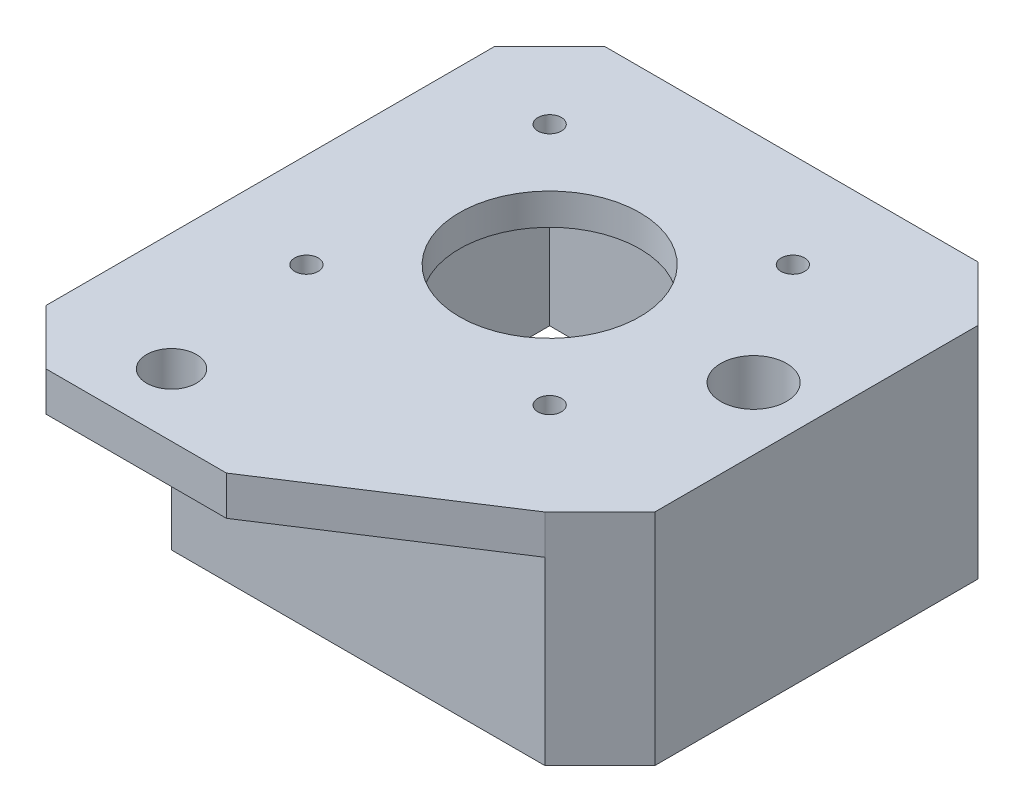
ISO-10303-21;
HEADER;
FILE_DESCRIPTION(('STEP AP214'),'2;1');
FILE_NAME('part.step','',(''),(''),'','','');
FILE_SCHEMA(('AUTOMOTIVE_DESIGN { 1 0 10303 214 1 1 1 1 }'));
ENDSEC;
DATA;
#1=APPLICATION_CONTEXT('core data for automotive mechanical design processes');
#2=APPLICATION_PROTOCOL_DEFINITION('international standard','automotive_design',2000,#1);
#3=PRODUCT_CONTEXT('',#1,'mechanical');
#4=PRODUCT('Part','Part','',(#3));
#5=PRODUCT_RELATED_PRODUCT_CATEGORY('part','',(#4));
#6=PRODUCT_DEFINITION_FORMATION('','',#4);
#7=PRODUCT_DEFINITION_CONTEXT('part definition',#1,'design');
#8=PRODUCT_DEFINITION('design','',#6,#7);
#9=PRODUCT_DEFINITION_SHAPE('','',#8);
#10=(LENGTH_UNIT() NAMED_UNIT(*) SI_UNIT(.MILLI.,.METRE.));
#11=(NAMED_UNIT(*) PLANE_ANGLE_UNIT() SI_UNIT($,.RADIAN.));
#12=(NAMED_UNIT(*) SI_UNIT($,.STERADIAN.) SOLID_ANGLE_UNIT());
#13=UNCERTAINTY_MEASURE_WITH_UNIT(LENGTH_MEASURE(1.E-05),#10,'distance_accuracy_value','');
#14=(GEOMETRIC_REPRESENTATION_CONTEXT(3) GLOBAL_UNCERTAINTY_ASSIGNED_CONTEXT((#13)) GLOBAL_UNIT_ASSIGNED_CONTEXT((#10,
#11,#12)) REPRESENTATION_CONTEXT('',''));
#15=CARTESIAN_POINT('',(0.,0.,0.));
#16=DIRECTION('',(0.,0.,1.));
#17=DIRECTION('',(1.,0.,0.));
#18=AXIS2_PLACEMENT_3D('',#15,#16,#17);
#19=CARTESIAN_POINT('',(48.6,-102.064588642995,6.6));
#20=DIRECTION('',(0.,0.,-1.));
#21=DIRECTION('',(-1.,0.,0.));
#22=AXIS2_PLACEMENT_3D('',#19,#20,#21);
#23=PLANE('',#22);
#24=DIRECTION('',(1.,0.,0.));
#25=VECTOR('',#24,1.);
#26=CARTESIAN_POINT('',(0.,-1.,6.6));
#27=LINE('',#26,#25);
#28=CARTESIAN_POINT('',(0.399999999999998,-1.,6.59999999999999));
#29=VERTEX_POINT('',#28);
#30=CARTESIAN_POINT('',(48.,-1.,6.59999999999999));
#31=VERTEX_POINT('',#30);
#32=EDGE_CURVE('E204',#29,#31,#27,.T.);
#33=ORIENTED_EDGE('',*,*,#32,.F.);
#34=DIRECTION('',(0.,1.,0.));
#35=VECTOR('',#34,1.);
#36=CARTESIAN_POINT('',(0.399999999999998,-33.8994949366117,6.59999999999999));
#37=LINE('',#36,#35);
#38=CARTESIAN_POINT('',(0.399999999999998,-24.,6.6));
#39=VERTEX_POINT('',#38);
#40=EDGE_CURVE('E237',#39,#29,#37,.T.);
#41=ORIENTED_EDGE('',*,*,#40,.F.);
#42=DIRECTION('',(-1.,0.,0.));
#43=VECTOR('',#42,1.);
#44=CARTESIAN_POINT('',(48.6,-24.,6.6));
#45=LINE('',#44,#43);
#46=CARTESIAN_POINT('',(48.,-24.,6.59999999999999));
#47=VERTEX_POINT('',#46);
#48=EDGE_CURVE('E269',#47,#39,#45,.T.);
#49=ORIENTED_EDGE('',*,*,#48,.F.);
#50=DIRECTION('',(0.,1.,0.));
#51=VECTOR('',#50,1.);
#52=CARTESIAN_POINT('',(48.,-33.8994949366117,6.59999999999999));
#53=LINE('',#52,#51);
#54=EDGE_CURVE('E252',#47,#31,#53,.T.);
#55=ORIENTED_EDGE('',*,*,#54,.T.);
#56=EDGE_LOOP('',(#33,#41,#49,#55));
#57=FACE_BOUND('',#56,.T.);
#58=ADVANCED_FACE('F59',(#57),#23,.F.);
#59=CARTESIAN_POINT('',(0.399999999999998,-33.8994949366117,6.59999999999999));
#60=DIRECTION('',(0.707106781186547,0.,-0.707106781186548));
#61=DIRECTION('',(-0.707106781186548,0.,-0.707106781186547));
#62=AXIS2_PLACEMENT_3D('',#59,#60,#61);
#63=PLANE('',#62);
#64=DIRECTION('',(0.707106781186548,0.,0.707106781186547));
#65=VECTOR('',#64,1.);
#66=CARTESIAN_POINT('',(-3.1,-1.,3.1));
#67=LINE('',#66,#65);
#68=CARTESIAN_POINT('',(-6.6,-1.,-0.400000000000005));
#69=VERTEX_POINT('',#68);
#70=EDGE_CURVE('E82',#69,#29,#67,.T.);
#71=ORIENTED_EDGE('',*,*,#70,.F.);
#72=DIRECTION('',(0.,1.,0.));
#73=VECTOR('',#72,1.);
#74=CARTESIAN_POINT('',(-6.6,-33.8994949366117,-0.400000000000005));
#75=LINE('',#74,#73);
#76=CARTESIAN_POINT('',(-6.6,-24.,-0.400000000000005));
#77=VERTEX_POINT('',#76);
#78=EDGE_CURVE('E193',#77,#69,#75,.T.);
#79=ORIENTED_EDGE('',*,*,#78,.F.);
#80=DIRECTION('',(-0.707106781186548,0.,-0.707106781186547));
#81=VECTOR('',#80,1.);
#82=CARTESIAN_POINT('',(0.399999999999998,-24.,6.59999999999999));
#83=LINE('',#82,#81);
#84=EDGE_CURVE('E218',#39,#77,#83,.T.);
#85=ORIENTED_EDGE('',*,*,#84,.F.);
#86=ORIENTED_EDGE('',*,*,#40,.T.);
#87=EDGE_LOOP('',(#71,#79,#85,#86));
#88=FACE_BOUND('',#87,.T.);
#89=ADVANCED_FACE('F375',(#88),#63,.F.);
#90=CARTESIAN_POINT('',(0.,0.,0.));
#91=DIRECTION('',(0.,-1.,0.));
#92=DIRECTION('',(0.,0.,-1.));
#93=AXIS2_PLACEMENT_3D('',#90,#91,#92);
#94=PLANE('',#93);
#95=CARTESIAN_POINT('',(5.5,0.,-5.49999999999998));
#96=DIRECTION('',(0.,1.,0.));
#97=DIRECTION('',(0.,0.,-1.));
#98=AXIS2_PLACEMENT_3D('',#95,#96,#97);
#99=CIRCLE('',#98,1.5);
#100=CARTESIAN_POINT('',(5.5,0.,-6.99999999999999));
#101=VERTEX_POINT('',#100);
#102=EDGE_CURVE('E311',#101,#101,#99,.T.);
#103=ORIENTED_EDGE('',*,*,#102,.T.);
#104=EDGE_LOOP('',(#103));
#105=FACE_BOUND('',#104,.T.);
#106=CARTESIAN_POINT('',(5.5,0.,-36.5));
#107=DIRECTION('',(0.,1.,0.));
#108=DIRECTION('',(0.,0.,1.));
#109=AXIS2_PLACEMENT_3D('',#106,#107,#108);
#110=CIRCLE('',#109,1.5);
#111=CARTESIAN_POINT('',(5.5,0.,-35.));
#112=VERTEX_POINT('',#111);
#113=EDGE_CURVE('E323',#112,#112,#110,.T.);
#114=ORIENTED_EDGE('',*,*,#113,.T.);
#115=EDGE_LOOP('',(#114));
#116=FACE_BOUND('',#115,.T.);
#117=CARTESIAN_POINT('',(21.,0.,-21.));
#118=DIRECTION('',(0.,1.,0.));
#119=DIRECTION('',(0.,0.,1.));
#120=AXIS2_PLACEMENT_3D('',#117,#118,#119);
#121=CIRCLE('',#120,11.5);
#122=CARTESIAN_POINT('',(21.,0.,-9.5));
#123=VERTEX_POINT('',#122);
#124=EDGE_CURVE('E329',#123,#123,#121,.T.);
#125=ORIENTED_EDGE('',*,*,#124,.T.);
#126=EDGE_LOOP('',(#125));
#127=FACE_BOUND('',#126,.T.);
#128=CARTESIAN_POINT('',(36.5,0.,-36.5));
#129=DIRECTION('',(0.,1.,0.));
#130=DIRECTION('',(0.,0.,-1.));
#131=AXIS2_PLACEMENT_3D('',#128,#129,#130);
#132=CIRCLE('',#131,1.5);
#133=CARTESIAN_POINT('',(36.5,0.,-38.));
#134=VERTEX_POINT('',#133);
#135=EDGE_CURVE('E317',#134,#134,#132,.T.);
#136=ORIENTED_EDGE('',*,*,#135,.T.);
#137=EDGE_LOOP('',(#136));
#138=FACE_BOUND('',#137,.T.);
#139=CARTESIAN_POINT('',(36.5,0.,-5.49999999999998));
#140=DIRECTION('',(0.,1.,0.));
#141=DIRECTION('',(0.,0.,1.));
#142=AXIS2_PLACEMENT_3D('',#139,#140,#141);
#143=CIRCLE('',#142,1.5);
#144=CARTESIAN_POINT('',(36.5,0.,-3.99999999999998));
#145=VERTEX_POINT('',#144);
#146=EDGE_CURVE('E306',#145,#145,#143,.T.);
#147=ORIENTED_EDGE('',*,*,#146,.T.);
#148=EDGE_LOOP('',(#147));
#149=FACE_BOUND('',#148,.T.);
#150=DIRECTION('',(-1.,0.,0.));
#151=VECTOR('',#150,1.);
#152=CARTESIAN_POINT('',(42.25,0.,0.249999999999997));
#153=LINE('',#152,#151);
#154=CARTESIAN_POINT('',(42.25,0.,0.249999999999997));
#155=VERTEX_POINT('',#154);
#156=CARTESIAN_POINT('',(-0.25,0.,0.24999999999999));
#157=VERTEX_POINT('',#156);
#158=EDGE_CURVE('E280',#155,#157,#153,.T.);
#159=ORIENTED_EDGE('',*,*,#158,.T.);
#160=DIRECTION('',(0.,0.,-1.));
#161=VECTOR('',#160,1.);
#162=CARTESIAN_POINT('',(-0.25,0.,0.24999999999999));
#163=LINE('',#162,#161);
#164=CARTESIAN_POINT('',(-0.249999999999993,0.,-42.25));
#165=VERTEX_POINT('',#164);
#166=EDGE_CURVE('E277',#157,#165,#163,.T.);
#167=ORIENTED_EDGE('',*,*,#166,.T.);
#168=DIRECTION('',(-1.,0.,0.));
#169=VECTOR('',#168,1.);
#170=CARTESIAN_POINT('',(42.25,0.,-42.25));
#171=LINE('',#170,#169);
#172=CARTESIAN_POINT('',(42.25,0.,-42.25));
#173=VERTEX_POINT('',#172);
#174=EDGE_CURVE('E275',#173,#165,#171,.T.);
#175=ORIENTED_EDGE('',*,*,#174,.F.);
#176=DIRECTION('',(0.,0.,-1.));
#177=VECTOR('',#176,1.);
#178=CARTESIAN_POINT('',(42.25,0.,0.));
#179=LINE('',#178,#177);
#180=EDGE_CURVE('E302',#155,#173,#179,.T.);
#181=ORIENTED_EDGE('',*,*,#180,.F.);
#182=EDGE_LOOP('',(#159,#167,#175,#181));
#183=FACE_BOUND('',#182,.T.);
#184=ADVANCED_FACE('F344',(#105,#116,#127,#138,#149,#183),#94,.T.);
#185=CARTESIAN_POINT('',(0.,4.,0.));
#186=DIRECTION('',(0.,-1.,0.));
#187=DIRECTION('',(0.,0.,-1.));
#188=AXIS2_PLACEMENT_3D('',#185,#186,#187);
#189=PLANE('',#188);
#190=DIRECTION('',(0.838287871127494,0.,-0.545227883660158));
#191=VECTOR('',#190,1.);
#192=CARTESIAN_POINT('',(17.2857076501463,4.,26.5767755121));
#193=LINE('',#192,#191);
#194=CARTESIAN_POINT('',(23.4,4.,22.6));
#195=VERTEX_POINT('',#194);
#196=CARTESIAN_POINT('',(48.,4.,6.6));
#197=VERTEX_POINT('',#196);
#198=EDGE_CURVE('E197',#195,#197,#193,.T.);
#199=ORIENTED_EDGE('',*,*,#198,.T.);
#200=DIRECTION('',(-0.707106781186548,0.,0.707106781186547));
#201=VECTOR('',#200,1.);
#202=CARTESIAN_POINT('',(55.,4.,-0.399999999999998));
#203=LINE('',#202,#201);
#204=CARTESIAN_POINT('',(55.,4.,-0.399999999999998));
#205=VERTEX_POINT('',#204);
#206=EDGE_CURVE('E232',#205,#197,#203,.T.);
#207=ORIENTED_EDGE('',*,*,#206,.F.);
#208=DIRECTION('',(0.,0.,-1.));
#209=VECTOR('',#208,1.);
#210=CARTESIAN_POINT('',(55.,4.,0.));
#211=LINE('',#210,#209);
#212=CARTESIAN_POINT('',(55.,4.,-41.6));
#213=VERTEX_POINT('',#212);
#214=EDGE_CURVE('E12',#205,#213,#211,.T.);
#215=ORIENTED_EDGE('',*,*,#214,.T.);
#216=DIRECTION('',(0.707106781186546,0.,0.707106781186549));
#217=VECTOR('',#216,1.);
#218=CARTESIAN_POINT('',(55.,4.,-41.6));
#219=LINE('',#218,#217);
#220=CARTESIAN_POINT('',(48.,4.,-48.6));
#221=VERTEX_POINT('',#220);
#222=EDGE_CURVE('E222',#221,#213,#219,.T.);
#223=ORIENTED_EDGE('',*,*,#222,.F.);
#224=DIRECTION('',(1.,0.,0.));
#225=VECTOR('',#224,1.);
#226=CARTESIAN_POINT('',(-7.7175125526299,4.,-48.6));
#227=LINE('',#226,#225);
#228=CARTESIAN_POINT('',(0.400000000000005,4.,-48.6));
#229=VERTEX_POINT('',#228);
#230=EDGE_CURVE('E258',#229,#221,#227,.T.);
#231=ORIENTED_EDGE('',*,*,#230,.F.);
#232=DIRECTION('',(0.707106781186548,0.,-0.707106781186547));
#233=VECTOR('',#232,1.);
#234=CARTESIAN_POINT('',(-6.6,4.,-41.6));
#235=LINE('',#234,#233);
#236=CARTESIAN_POINT('',(-6.6,4.,-41.6));
#237=VERTEX_POINT('',#236);
#238=EDGE_CURVE('E234',#237,#229,#235,.T.);
#239=ORIENTED_EDGE('',*,*,#238,.F.);
#240=DIRECTION('',(0.,0.,-1.));
#241=VECTOR('',#240,1.);
#242=CARTESIAN_POINT('',(-6.6,4.,14.3175125526299));
#243=LINE('',#242,#241);
#244=CARTESIAN_POINT('',(-6.6,4.,15.6));
#245=VERTEX_POINT('',#244);
#246=EDGE_CURVE('E256',#245,#237,#243,.T.);
#247=ORIENTED_EDGE('',*,*,#246,.F.);
#248=DIRECTION('',(0.707106781186548,0.,0.707106781186547));
#249=VECTOR('',#248,1.);
#250=CARTESIAN_POINT('',(-11.1,4.,11.1));
#251=LINE('',#250,#249);
#252=CARTESIAN_POINT('',(0.399999999999999,4.,22.6));
#253=VERTEX_POINT('',#252);
#254=EDGE_CURVE('E176',#245,#253,#251,.T.);
#255=ORIENTED_EDGE('',*,*,#254,.T.);
#256=DIRECTION('',(1.,0.,0.));
#257=VECTOR('',#256,1.);
#258=CARTESIAN_POINT('',(0.,4.,22.6));
#259=LINE('',#258,#257);
#260=EDGE_CURVE('E212',#253,#195,#259,.T.);
#261=ORIENTED_EDGE('',*,*,#260,.T.);
#262=EDGE_LOOP('',(#199,#207,#215,#223,#231,#239,#247,#255,#261));
#263=FACE_BOUND('',#262,.T.);
#264=CARTESIAN_POINT('',(47.,4.,-21.));
#265=DIRECTION('',(0.,1.,0.));
#266=DIRECTION('',(0.,0.,1.));
#267=AXIS2_PLACEMENT_3D('',#264,#265,#266);
#268=CIRCLE('',#267,4.2);
#269=CARTESIAN_POINT('',(47.,4.,-16.8));
#270=VERTEX_POINT('',#269);
#271=EDGE_CURVE('E67',#270,#270,#268,.T.);
#272=ORIENTED_EDGE('',*,*,#271,.F.);
#273=EDGE_LOOP('',(#272));
#274=FACE_BOUND('',#273,.T.);
#275=CARTESIAN_POINT('',(21.,4.,-21.));
#276=DIRECTION('',(0.,1.,0.));
#277=DIRECTION('',(0.,0.,1.));
#278=AXIS2_PLACEMENT_3D('',#275,#276,#277);
#279=CIRCLE('',#278,11.5);
#280=CARTESIAN_POINT('',(21.,4.,-9.5));
#281=VERTEX_POINT('',#280);
#282=EDGE_CURVE('E332',#281,#281,#279,.T.);
#283=ORIENTED_EDGE('',*,*,#282,.F.);
#284=EDGE_LOOP('',(#283));
#285=FACE_BOUND('',#284,.T.);
#286=CARTESIAN_POINT('',(5.5,4.,-36.5));
#287=DIRECTION('',(0.,1.,0.));
#288=DIRECTION('',(0.,0.,1.));
#289=AXIS2_PLACEMENT_3D('',#286,#287,#288);
#290=CIRCLE('',#289,1.5);
#291=CARTESIAN_POINT('',(5.5,4.,-35.));
#292=VERTEX_POINT('',#291);
#293=EDGE_CURVE('E326',#292,#292,#290,.T.);
#294=ORIENTED_EDGE('',*,*,#293,.F.);
#295=EDGE_LOOP('',(#294));
#296=FACE_BOUND('',#295,.T.);
#297=CARTESIAN_POINT('',(36.5,4.,-36.5));
#298=DIRECTION('',(0.,1.,0.));
#299=DIRECTION('',(0.,0.,-1.));
#300=AXIS2_PLACEMENT_3D('',#297,#298,#299);
#301=CIRCLE('',#300,1.5);
#302=CARTESIAN_POINT('',(36.5,4.,-38.));
#303=VERTEX_POINT('',#302);
#304=EDGE_CURVE('E320',#303,#303,#301,.T.);
#305=ORIENTED_EDGE('',*,*,#304,.F.);
#306=EDGE_LOOP('',(#305));
#307=FACE_BOUND('',#306,.T.);
#308=CARTESIAN_POINT('',(5.5,4.,-5.49999999999998));
#309=DIRECTION('',(0.,1.,0.));
#310=DIRECTION('',(0.,0.,-1.));
#311=AXIS2_PLACEMENT_3D('',#308,#309,#310);
#312=CIRCLE('',#311,1.5);
#313=CARTESIAN_POINT('',(5.5,4.,-6.99999999999999));
#314=VERTEX_POINT('',#313);
#315=EDGE_CURVE('E314',#314,#314,#312,.T.);
#316=ORIENTED_EDGE('',*,*,#315,.F.);
#317=EDGE_LOOP('',(#316));
#318=FACE_BOUND('',#317,.T.);
#319=CARTESIAN_POINT('',(36.5,4.,-5.49999999999998));
#320=DIRECTION('',(0.,1.,0.));
#321=DIRECTION('',(0.,0.,1.));
#322=AXIS2_PLACEMENT_3D('',#319,#320,#321);
#323=CIRCLE('',#322,1.5);
#324=CARTESIAN_POINT('',(36.5,4.,-3.99999999999998));
#325=VERTEX_POINT('',#324);
#326=EDGE_CURVE('E308',#325,#325,#323,.T.);
#327=ORIENTED_EDGE('',*,*,#326,.F.);
#328=EDGE_LOOP('',(#327));
#329=FACE_BOUND('',#328,.T.);
#330=CARTESIAN_POINT('',(8.4,4.,14.6));
#331=DIRECTION('',(0.,1.,0.));
#332=DIRECTION('',(0.,0.,1.));
#333=AXIS2_PLACEMENT_3D('',#330,#331,#332);
#334=CIRCLE('',#333,3.175);
#335=CARTESIAN_POINT('',(8.4,4.,17.775));
#336=VERTEX_POINT('',#335);
#337=EDGE_CURVE('E208',#336,#336,#334,.T.);
#338=ORIENTED_EDGE('',*,*,#337,.F.);
#339=EDGE_LOOP('',(#338));
#340=FACE_BOUND('',#339,.T.);
#341=ADVANCED_FACE('F341',(#263,#274,#285,#296,#307,#318,#329,#340),#189,.F.);
#342=CARTESIAN_POINT('',(55.,4.,0.));
#343=DIRECTION('',(-1.,0.,0.));
#344=DIRECTION('',(0.,0.,1.));
#345=AXIS2_PLACEMENT_3D('',#342,#343,#344);
#346=PLANE('',#345);
#347=DIRECTION('',(0.,0.,1.));
#348=VECTOR('',#347,1.);
#349=CARTESIAN_POINT('',(55.,-24.,-31.));
#350=LINE('',#349,#348);
#351=CARTESIAN_POINT('',(55.,-24.,-41.6));
#352=VERTEX_POINT('',#351);
#353=CARTESIAN_POINT('',(55.,-24.,-0.399999999999998));
#354=VERTEX_POINT('',#353);
#355=EDGE_CURVE('E297',#352,#354,#350,.T.);
#356=ORIENTED_EDGE('',*,*,#355,.F.);
#357=DIRECTION('',(0.,1.,0.));
#358=VECTOR('',#357,1.);
#359=CARTESIAN_POINT('',(55.,-33.8994949366117,-41.6));
#360=LINE('',#359,#358);
#361=EDGE_CURVE('E229',#352,#213,#360,.T.);
#362=ORIENTED_EDGE('',*,*,#361,.T.);
#363=ORIENTED_EDGE('',*,*,#214,.F.);
#364=DIRECTION('',(0.,1.,0.));
#365=VECTOR('',#364,1.);
#366=CARTESIAN_POINT('',(55.,-33.8994949366117,-0.399999999999998));
#367=LINE('',#366,#365);
#368=EDGE_CURVE('E254',#354,#205,#367,.T.);
#369=ORIENTED_EDGE('',*,*,#368,.F.);
#370=EDGE_LOOP('',(#356,#362,#363,#369));
#371=FACE_BOUND('',#370,.T.);
#372=ADVANCED_FACE('F61',(#371),#346,.F.);
#373=CARTESIAN_POINT('',(47.,4.,-21.));
#374=DIRECTION('',(0.,-1.,0.));
#375=DIRECTION('',(0.,0.,-1.));
#376=AXIS2_PLACEMENT_3D('',#373,#374,#375);
#377=CYLINDRICAL_SURFACE('',#376,4.2);
#378=CARTESIAN_POINT('',(47.,-20.,-21.));
#379=DIRECTION('',(0.,-1.,0.));
#380=DIRECTION('',(0.,0.,-1.));
#381=AXIS2_PLACEMENT_3D('',#378,#379,#380);
#382=CIRCLE('',#381,4.2);
#383=CARTESIAN_POINT('',(47.,-20.,-25.2));
#384=VERTEX_POINT('',#383);
#385=EDGE_CURVE('E303',#384,#384,#382,.F.);
#386=ORIENTED_EDGE('',*,*,#385,.F.);
#387=EDGE_LOOP('',(#386));
#388=FACE_BOUND('',#387,.T.);
#389=ORIENTED_EDGE('',*,*,#271,.T.);
#390=EDGE_LOOP('',(#389));
#391=FACE_BOUND('',#390,.T.);
#392=ADVANCED_FACE('F339',(#388,#391),#377,.F.);
#393=CARTESIAN_POINT('',(21.,4.,-21.));
#394=DIRECTION('',(0.,-1.,0.));
#395=DIRECTION('',(0.,0.,-1.));
#396=AXIS2_PLACEMENT_3D('',#393,#394,#395);
#397=CYLINDRICAL_SURFACE('',#396,11.5);
#398=ORIENTED_EDGE('',*,*,#282,.T.);
#399=EDGE_LOOP('',(#398));
#400=FACE_BOUND('',#399,.T.);
#401=ORIENTED_EDGE('',*,*,#124,.F.);
#402=EDGE_LOOP('',(#401));
#403=FACE_BOUND('',#402,.T.);
#404=ADVANCED_FACE('F420',(#400,#403),#397,.F.);
#405=CARTESIAN_POINT('',(5.5,4.,-36.5));
#406=DIRECTION('',(0.,-1.,0.));
#407=DIRECTION('',(0.,0.,-1.));
#408=AXIS2_PLACEMENT_3D('',#405,#406,#407);
#409=CYLINDRICAL_SURFACE('',#408,1.5);
#410=ORIENTED_EDGE('',*,*,#293,.T.);
#411=EDGE_LOOP('',(#410));
#412=FACE_BOUND('',#411,.T.);
#413=ORIENTED_EDGE('',*,*,#113,.F.);
#414=EDGE_LOOP('',(#413));
#415=FACE_BOUND('',#414,.T.);
#416=ADVANCED_FACE('F416',(#412,#415),#409,.F.);
#417=CARTESIAN_POINT('',(36.5,4.,-36.5));
#418=DIRECTION('',(0.,-1.,0.));
#419=DIRECTION('',(0.,0.,-1.));
#420=AXIS2_PLACEMENT_3D('',#417,#418,#419);
#421=CYLINDRICAL_SURFACE('',#420,1.5);
#422=ORIENTED_EDGE('',*,*,#304,.T.);
#423=EDGE_LOOP('',(#422));
#424=FACE_BOUND('',#423,.T.);
#425=ORIENTED_EDGE('',*,*,#135,.F.);
#426=EDGE_LOOP('',(#425));
#427=FACE_BOUND('',#426,.T.);
#428=ADVANCED_FACE('F412',(#424,#427),#421,.F.);
#429=CARTESIAN_POINT('',(5.5,4.,-5.49999999999998));
#430=DIRECTION('',(0.,-1.,0.));
#431=DIRECTION('',(0.,0.,-1.));
#432=AXIS2_PLACEMENT_3D('',#429,#430,#431);
#433=CYLINDRICAL_SURFACE('',#432,1.5);
#434=ORIENTED_EDGE('',*,*,#315,.T.);
#435=EDGE_LOOP('',(#434));
#436=FACE_BOUND('',#435,.T.);
#437=ORIENTED_EDGE('',*,*,#102,.F.);
#438=EDGE_LOOP('',(#437));
#439=FACE_BOUND('',#438,.T.);
#440=ADVANCED_FACE('F408',(#436,#439),#433,.F.);
#441=CARTESIAN_POINT('',(36.5,4.,-5.49999999999998));
#442=DIRECTION('',(0.,-1.,0.));
#443=DIRECTION('',(0.,0.,-1.));
#444=AXIS2_PLACEMENT_3D('',#441,#442,#443);
#445=CYLINDRICAL_SURFACE('',#444,1.5);
#446=ORIENTED_EDGE('',*,*,#326,.T.);
#447=EDGE_LOOP('',(#446));
#448=FACE_BOUND('',#447,.T.);
#449=ORIENTED_EDGE('',*,*,#146,.F.);
#450=EDGE_LOOP('',(#449));
#451=FACE_BOUND('',#450,.T.);
#452=ADVANCED_FACE('F404',(#448,#451),#445,.F.);
#453=CARTESIAN_POINT('',(42.25,-20.,0.));
#454=DIRECTION('',(1.,0.,0.));
#455=DIRECTION('',(0.,0.,-1.));
#456=AXIS2_PLACEMENT_3D('',#453,#454,#455);
#457=PLANE('',#456);
#458=ORIENTED_EDGE('',*,*,#180,.T.);
#459=DIRECTION('',(0.,1.,0.));
#460=VECTOR('',#459,1.);
#461=CARTESIAN_POINT('',(42.25,-102.064588642995,-42.25));
#462=LINE('',#461,#460);
#463=CARTESIAN_POINT('',(42.25,-24.,-42.25));
#464=VERTEX_POINT('',#463);
#465=EDGE_CURVE('E283',#464,#173,#462,.T.);
#466=ORIENTED_EDGE('',*,*,#465,.F.);
#467=DIRECTION('',(0.,0.,-1.));
#468=VECTOR('',#467,1.);
#469=CARTESIAN_POINT('',(42.25,-24.,-31.));
#470=LINE('',#469,#468);
#471=CARTESIAN_POINT('',(42.25,-24.,0.249999999999997));
#472=VERTEX_POINT('',#471);
#473=EDGE_CURVE('E300',#472,#464,#470,.T.);
#474=ORIENTED_EDGE('',*,*,#473,.F.);
#475=DIRECTION('',(0.,1.,0.));
#476=VECTOR('',#475,1.);
#477=CARTESIAN_POINT('',(42.25,-102.064588642995,0.249999999999997));
#478=LINE('',#477,#476);
#479=EDGE_CURVE('E287',#472,#155,#478,.T.);
#480=ORIENTED_EDGE('',*,*,#479,.T.);
#481=EDGE_LOOP('',(#458,#466,#474,#480));
#482=FACE_BOUND('',#481,.T.);
#483=ADVANCED_FACE('F400',(#482),#457,.F.);
#484=CARTESIAN_POINT('',(0.,-20.,0.));
#485=DIRECTION('',(0.,-1.,0.));
#486=DIRECTION('',(0.,0.,-1.));
#487=AXIS2_PLACEMENT_3D('',#484,#485,#486);
#488=PLANE('',#487);
#489=ORIENTED_EDGE('',*,*,#385,.T.);
#490=EDGE_LOOP('',(#489));
#491=FACE_BOUND('',#490,.T.);
#492=ADVANCED_FACE('F396',(#491),#488,.F.);
#493=CARTESIAN_POINT('',(0.,-24.,0.));
#494=DIRECTION('',(0.,-1.,0.));
#495=DIRECTION('',(0.,0.,-1.));
#496=AXIS2_PLACEMENT_3D('',#493,#494,#495);
#497=PLANE('',#496);
#498=ORIENTED_EDGE('',*,*,#84,.T.);
#499=DIRECTION('',(0.,0.,-1.));
#500=VECTOR('',#499,1.);
#501=CARTESIAN_POINT('',(-6.6,-24.,6.59999999999999));
#502=LINE('',#501,#500);
#503=CARTESIAN_POINT('',(-6.6,-24.,-41.6));
#504=VERTEX_POINT('',#503);
#505=EDGE_CURVE('E266',#77,#504,#502,.T.);
#506=ORIENTED_EDGE('',*,*,#505,.T.);
#507=DIRECTION('',(0.707106781186548,0.,-0.707106781186547));
#508=VECTOR('',#507,1.);
#509=CARTESIAN_POINT('',(-6.6,-24.,-41.6));
#510=LINE('',#509,#508);
#511=CARTESIAN_POINT('',(0.400000000000005,-24.,-48.6));
#512=VERTEX_POINT('',#511);
#513=EDGE_CURVE('E238',#504,#512,#510,.T.);
#514=ORIENTED_EDGE('',*,*,#513,.T.);
#515=DIRECTION('',(-1.,0.,0.));
#516=VECTOR('',#515,1.);
#517=CARTESIAN_POINT('',(48.6,-24.,-48.6));
#518=LINE('',#517,#516);
#519=CARTESIAN_POINT('',(48.,-24.,-48.6));
#520=VERTEX_POINT('',#519);
#521=EDGE_CURVE('E272',#520,#512,#518,.T.);
#522=ORIENTED_EDGE('',*,*,#521,.F.);
#523=DIRECTION('',(0.707106781186546,0.,0.707106781186549));
#524=VECTOR('',#523,1.);
#525=CARTESIAN_POINT('',(55.,-24.,-41.6));
#526=LINE('',#525,#524);
#527=EDGE_CURVE('E226',#520,#352,#526,.T.);
#528=ORIENTED_EDGE('',*,*,#527,.T.);
#529=ORIENTED_EDGE('',*,*,#355,.T.);
#530=DIRECTION('',(-0.707106781186548,0.,0.707106781186547));
#531=VECTOR('',#530,1.);
#532=CARTESIAN_POINT('',(55.,-24.,-0.399999999999998));
#533=LINE('',#532,#531);
#534=EDGE_CURVE('E249',#354,#47,#533,.T.);
#535=ORIENTED_EDGE('',*,*,#534,.T.);
#536=ORIENTED_EDGE('',*,*,#48,.T.);
#537=EDGE_LOOP('',(#498,#506,#514,#522,#528,#529,#535,#536));
#538=FACE_BOUND('',#537,.T.);
#539=ORIENTED_EDGE('',*,*,#473,.T.);
#540=DIRECTION('',(-1.,0.,0.));
#541=VECTOR('',#540,1.);
#542=CARTESIAN_POINT('',(42.25,-24.,-42.25));
#543=LINE('',#542,#541);
#544=CARTESIAN_POINT('',(-0.249999999999993,-24.,-42.25));
#545=VERTEX_POINT('',#544);
#546=EDGE_CURVE('E264',#464,#545,#543,.T.);
#547=ORIENTED_EDGE('',*,*,#546,.T.);
#548=DIRECTION('',(0.,0.,-1.));
#549=VECTOR('',#548,1.);
#550=CARTESIAN_POINT('',(-0.25,-24.,0.24999999999999));
#551=LINE('',#550,#549);
#552=CARTESIAN_POINT('',(-0.25,-24.,0.24999999999999));
#553=VERTEX_POINT('',#552);
#554=EDGE_CURVE('E286',#553,#545,#551,.T.);
#555=ORIENTED_EDGE('',*,*,#554,.F.);
#556=DIRECTION('',(-1.,0.,0.));
#557=VECTOR('',#556,1.);
#558=CARTESIAN_POINT('',(42.25,-24.,0.249999999999997));
#559=LINE('',#558,#557);
#560=EDGE_CURVE('E261',#472,#553,#559,.T.);
#561=ORIENTED_EDGE('',*,*,#560,.F.);
#562=EDGE_LOOP('',(#539,#547,#555,#561));
#563=FACE_BOUND('',#562,.T.);
#564=ADVANCED_FACE('F389',(#538,#563),#497,.T.);
#565=CARTESIAN_POINT('',(-6.6,-102.064588642995,6.59999999999999));
#566=DIRECTION('',(1.,0.,0.));
#567=DIRECTION('',(0.,0.,-1.));
#568=AXIS2_PLACEMENT_3D('',#565,#566,#567);
#569=PLANE('',#568);
#570=ORIENTED_EDGE('',*,*,#505,.F.);
#571=ORIENTED_EDGE('',*,*,#78,.T.);
#572=DIRECTION('',(0.,0.,1.));
#573=VECTOR('',#572,1.);
#574=CARTESIAN_POINT('',(-6.6,-1.,0.));
#575=LINE('',#574,#573);
#576=CARTESIAN_POINT('',(-6.6,-1.,15.6));
#577=VERTEX_POINT('',#576);
#578=EDGE_CURVE('E186',#69,#577,#575,.T.);
#579=ORIENTED_EDGE('',*,*,#578,.T.);
#580=DIRECTION('',(0.,1.,0.));
#581=VECTOR('',#580,1.);
#582=CARTESIAN_POINT('',(-6.6,-1.,15.6));
#583=LINE('',#582,#581);
#584=EDGE_CURVE('E171',#577,#245,#583,.T.);
#585=ORIENTED_EDGE('',*,*,#584,.T.);
#586=ORIENTED_EDGE('',*,*,#246,.T.);
#587=DIRECTION('',(0.,1.,0.));
#588=VECTOR('',#587,1.);
#589=CARTESIAN_POINT('',(-6.6,-33.8994949366117,-41.6));
#590=LINE('',#589,#588);
#591=EDGE_CURVE('E236',#504,#237,#590,.T.);
#592=ORIENTED_EDGE('',*,*,#591,.F.);
#593=EDGE_LOOP('',(#570,#571,#579,#585,#586,#592));
#594=FACE_BOUND('',#593,.T.);
#595=ADVANCED_FACE('F192',(#594),#569,.F.);
#596=CARTESIAN_POINT('',(48.6,-102.064588642995,-48.6));
#597=DIRECTION('',(0.,0.,-1.));
#598=DIRECTION('',(-1.,0.,0.));
#599=AXIS2_PLACEMENT_3D('',#596,#597,#598);
#600=PLANE('',#599);
#601=DIRECTION('',(0.,1.,0.));
#602=VECTOR('',#601,1.);
#603=CARTESIAN_POINT('',(0.400000000000005,-33.8994949366117,-48.6));
#604=LINE('',#603,#602);
#605=EDGE_CURVE('E225',#512,#229,#604,.T.);
#606=ORIENTED_EDGE('',*,*,#605,.T.);
#607=ORIENTED_EDGE('',*,*,#230,.T.);
#608=DIRECTION('',(0.,1.,0.));
#609=VECTOR('',#608,1.);
#610=CARTESIAN_POINT('',(48.,-33.8994949366117,-48.6));
#611=LINE('',#610,#609);
#612=EDGE_CURVE('E224',#520,#221,#611,.T.);
#613=ORIENTED_EDGE('',*,*,#612,.F.);
#614=ORIENTED_EDGE('',*,*,#521,.T.);
#615=EDGE_LOOP('',(#606,#607,#613,#614));
#616=FACE_BOUND('',#615,.T.);
#617=ADVANCED_FACE('F388',(#616),#600,.T.);
#618=CARTESIAN_POINT('',(-0.25,-102.064588642995,0.24999999999999));
#619=DIRECTION('',(1.,0.,0.));
#620=DIRECTION('',(0.,0.,-1.));
#621=AXIS2_PLACEMENT_3D('',#618,#619,#620);
#622=PLANE('',#621);
#623=DIRECTION('',(0.,1.,0.));
#624=VECTOR('',#623,1.);
#625=CARTESIAN_POINT('',(-0.25,-102.064588642995,0.24999999999999));
#626=LINE('',#625,#624);
#627=EDGE_CURVE('E290',#553,#157,#626,.T.);
#628=ORIENTED_EDGE('',*,*,#627,.F.);
#629=ORIENTED_EDGE('',*,*,#554,.T.);
#630=DIRECTION('',(0.,1.,0.));
#631=VECTOR('',#630,1.);
#632=CARTESIAN_POINT('',(-0.249999999999993,-102.064588642995,-42.25));
#633=LINE('',#632,#631);
#634=EDGE_CURVE('E282',#545,#165,#633,.T.);
#635=ORIENTED_EDGE('',*,*,#634,.T.);
#636=ORIENTED_EDGE('',*,*,#166,.F.);
#637=EDGE_LOOP('',(#628,#629,#635,#636));
#638=FACE_BOUND('',#637,.T.);
#639=ADVANCED_FACE('F392',(#638),#622,.T.);
#640=CARTESIAN_POINT('',(42.25,-102.064588642995,0.249999999999997));
#641=DIRECTION('',(0.,0.,-1.));
#642=DIRECTION('',(-1.,0.,0.));
#643=AXIS2_PLACEMENT_3D('',#640,#641,#642);
#644=PLANE('',#643);
#645=ORIENTED_EDGE('',*,*,#479,.F.);
#646=ORIENTED_EDGE('',*,*,#560,.T.);
#647=ORIENTED_EDGE('',*,*,#627,.T.);
#648=ORIENTED_EDGE('',*,*,#158,.F.);
#649=EDGE_LOOP('',(#645,#646,#647,#648));
#650=FACE_BOUND('',#649,.T.);
#651=ADVANCED_FACE('F447',(#650),#644,.T.);
#652=CARTESIAN_POINT('',(42.25,-102.064588642995,-42.25));
#653=DIRECTION('',(0.,0.,-1.));
#654=DIRECTION('',(-1.,0.,0.));
#655=AXIS2_PLACEMENT_3D('',#652,#653,#654);
#656=PLANE('',#655);
#657=ORIENTED_EDGE('',*,*,#546,.F.);
#658=ORIENTED_EDGE('',*,*,#465,.T.);
#659=ORIENTED_EDGE('',*,*,#174,.T.);
#660=ORIENTED_EDGE('',*,*,#634,.F.);
#661=EDGE_LOOP('',(#657,#658,#659,#660));
#662=FACE_BOUND('',#661,.T.);
#663=ADVANCED_FACE('F384',(#662),#656,.F.);
#664=CARTESIAN_POINT('',(55.,-33.8994949366117,-41.6));
#665=DIRECTION('',(-0.707106781186549,0.,0.707106781186546));
#666=DIRECTION('',(0.707106781186546,0.,0.707106781186549));
#667=AXIS2_PLACEMENT_3D('',#664,#665,#666);
#668=PLANE('',#667);
#669=ORIENTED_EDGE('',*,*,#612,.T.);
#670=ORIENTED_EDGE('',*,*,#222,.T.);
#671=ORIENTED_EDGE('',*,*,#361,.F.);
#672=ORIENTED_EDGE('',*,*,#527,.F.);
#673=EDGE_LOOP('',(#669,#670,#671,#672));
#674=FACE_BOUND('',#673,.T.);
#675=ADVANCED_FACE('F456',(#674),#668,.F.);
#676=CARTESIAN_POINT('',(-6.6,-33.8994949366117,-41.6));
#677=DIRECTION('',(0.707106781186547,0.,0.707106781186548));
#678=DIRECTION('',(0.707106781186548,0.,-0.707106781186547));
#679=AXIS2_PLACEMENT_3D('',#676,#677,#678);
#680=PLANE('',#679);
#681=ORIENTED_EDGE('',*,*,#591,.T.);
#682=ORIENTED_EDGE('',*,*,#238,.T.);
#683=ORIENTED_EDGE('',*,*,#605,.F.);
#684=ORIENTED_EDGE('',*,*,#513,.F.);
#685=EDGE_LOOP('',(#681,#682,#683,#684));
#686=FACE_BOUND('',#685,.T.);
#687=ADVANCED_FACE('F461',(#686),#680,.F.);
#688=CARTESIAN_POINT('',(55.,-33.8994949366117,-0.399999999999998));
#689=DIRECTION('',(-0.707106781186547,0.,-0.707106781186548));
#690=DIRECTION('',(-0.707106781186548,0.,0.707106781186547));
#691=AXIS2_PLACEMENT_3D('',#688,#689,#690);
#692=PLANE('',#691);
#693=ORIENTED_EDGE('',*,*,#368,.T.);
#694=ORIENTED_EDGE('',*,*,#206,.T.);
#695=DIRECTION('',(0.,1.,0.));
#696=VECTOR('',#695,1.);
#697=CARTESIAN_POINT('',(48.,-1.,6.6));
#698=LINE('',#697,#696);
#699=EDGE_CURVE('E74',#31,#197,#698,.T.);
#700=ORIENTED_EDGE('',*,*,#699,.F.);
#701=ORIENTED_EDGE('',*,*,#54,.F.);
#702=ORIENTED_EDGE('',*,*,#534,.F.);
#703=EDGE_LOOP('',(#693,#694,#700,#701,#702));
#704=FACE_BOUND('',#703,.T.);
#705=ADVANCED_FACE('F468',(#704),#692,.F.);
#706=CARTESIAN_POINT('',(17.2857076501463,-1.,26.5767755121));
#707=DIRECTION('',(0.545227883660158,0.,0.838287871127494));
#708=DIRECTION('',(0.838287871127494,0.,-0.545227883660158));
#709=AXIS2_PLACEMENT_3D('',#706,#707,#708);
#710=PLANE('',#709);
#711=ORIENTED_EDGE('',*,*,#198,.F.);
#712=DIRECTION('',(0.,1.,0.));
#713=VECTOR('',#712,1.);
#714=CARTESIAN_POINT('',(23.4,-1.,22.6));
#715=LINE('',#714,#713);
#716=CARTESIAN_POINT('',(23.4,-1.,22.6));
#717=VERTEX_POINT('',#716);
#718=EDGE_CURVE('E219',#717,#195,#715,.T.);
#719=ORIENTED_EDGE('',*,*,#718,.F.);
#720=DIRECTION('',(0.838287871127494,0.,-0.545227883660158));
#721=VECTOR('',#720,1.);
#722=CARTESIAN_POINT('',(17.2857076501463,-1.,26.5767755121));
#723=LINE('',#722,#721);
#724=EDGE_CURVE('E201',#717,#31,#723,.T.);
#725=ORIENTED_EDGE('',*,*,#724,.T.);
#726=ORIENTED_EDGE('',*,*,#699,.T.);
#727=EDGE_LOOP('',(#711,#719,#725,#726));
#728=FACE_BOUND('',#727,.T.);
#729=ADVANCED_FACE('F369',(#728),#710,.T.);
#730=CARTESIAN_POINT('',(0.,-1.,22.6));
#731=DIRECTION('',(0.,0.,1.));
#732=DIRECTION('',(1.,0.,0.));
#733=AXIS2_PLACEMENT_3D('',#730,#731,#732);
#734=PLANE('',#733);
#735=ORIENTED_EDGE('',*,*,#260,.F.);
#736=DIRECTION('',(0.,1.,0.));
#737=VECTOR('',#736,1.);
#738=CARTESIAN_POINT('',(0.399999999999999,-1.,22.6));
#739=LINE('',#738,#737);
#740=CARTESIAN_POINT('',(0.399999999999999,-1.,22.6));
#741=VERTEX_POINT('',#740);
#742=EDGE_CURVE('E180',#741,#253,#739,.T.);
#743=ORIENTED_EDGE('',*,*,#742,.F.);
#744=DIRECTION('',(1.,0.,0.));
#745=VECTOR('',#744,1.);
#746=CARTESIAN_POINT('',(0.,-1.,22.6));
#747=LINE('',#746,#745);
#748=EDGE_CURVE('E189',#741,#717,#747,.T.);
#749=ORIENTED_EDGE('',*,*,#748,.T.);
#750=ORIENTED_EDGE('',*,*,#718,.T.);
#751=EDGE_LOOP('',(#735,#743,#749,#750));
#752=FACE_BOUND('',#751,.T.);
#753=ADVANCED_FACE('F361',(#752),#734,.T.);
#754=CARTESIAN_POINT('',(8.4,-1.,14.6));
#755=DIRECTION('',(0.,1.,0.));
#756=DIRECTION('',(0.,0.,1.));
#757=AXIS2_PLACEMENT_3D('',#754,#755,#756);
#758=CYLINDRICAL_SURFACE('',#757,3.175);
#759=CARTESIAN_POINT('',(8.4,-1.,14.6));
#760=DIRECTION('',(0.,1.,0.));
#761=DIRECTION('',(0.,0.,1.));
#762=AXIS2_PLACEMENT_3D('',#759,#760,#761);
#763=CIRCLE('',#762,3.175);
#764=CARTESIAN_POINT('',(8.4,-1.,17.775));
#765=VERTEX_POINT('',#764);
#766=EDGE_CURVE('E194',#765,#765,#763,.T.);
#767=ORIENTED_EDGE('',*,*,#766,.F.);
#768=EDGE_LOOP('',(#767));
#769=FACE_BOUND('',#768,.T.);
#770=ORIENTED_EDGE('',*,*,#337,.T.);
#771=EDGE_LOOP('',(#770));
#772=FACE_BOUND('',#771,.T.);
#773=ADVANCED_FACE('F359',(#769,#772),#758,.F.);
#774=CARTESIAN_POINT('',(-11.1,-1.,11.1));
#775=DIRECTION('',(-0.707106781186547,0.,0.707106781186548));
#776=DIRECTION('',(0.707106781186548,0.,0.707106781186547));
#777=AXIS2_PLACEMENT_3D('',#774,#775,#776);
#778=PLANE('',#777);
#779=ORIENTED_EDGE('',*,*,#254,.F.);
#780=ORIENTED_EDGE('',*,*,#584,.F.);
#781=DIRECTION('',(0.707106781186548,0.,0.707106781186547));
#782=VECTOR('',#781,1.);
#783=CARTESIAN_POINT('',(-11.1,-1.,11.1));
#784=LINE('',#783,#782);
#785=EDGE_CURVE('E174',#577,#741,#784,.T.);
#786=ORIENTED_EDGE('',*,*,#785,.T.);
#787=ORIENTED_EDGE('',*,*,#742,.T.);
#788=EDGE_LOOP('',(#779,#780,#786,#787));
#789=FACE_BOUND('',#788,.T.);
#790=ADVANCED_FACE('F173',(#789),#778,.T.);
#791=CARTESIAN_POINT('',(0.,-1.,0.));
#792=DIRECTION('',(0.,1.,0.));
#793=DIRECTION('',(0.,0.,1.));
#794=AXIS2_PLACEMENT_3D('',#791,#792,#793);
#795=PLANE('',#794);
#796=ORIENTED_EDGE('',*,*,#766,.T.);
#797=EDGE_LOOP('',(#796));
#798=FACE_BOUND('',#797,.T.);
#799=ORIENTED_EDGE('',*,*,#578,.F.);
#800=ORIENTED_EDGE('',*,*,#70,.T.);
#801=ORIENTED_EDGE('',*,*,#32,.T.);
#802=ORIENTED_EDGE('',*,*,#724,.F.);
#803=ORIENTED_EDGE('',*,*,#748,.F.);
#804=ORIENTED_EDGE('',*,*,#785,.F.);
#805=EDGE_LOOP('',(#799,#800,#801,#802,#803,#804));
#806=FACE_BOUND('',#805,.T.);
#807=ADVANCED_FACE('F185',(#798,#806),#795,.F.);
#808=CLOSED_SHELL('',(#58,#89,#184,#341,#372,#392,#404,#416,#428,#440,#452,#483,#492,#564,#595,
#617,#639,#651,#663,#675,#687,#705,#729,#753,#773,#790,#807));
#809=MANIFOLD_SOLID_BREP('B2',#808);
#810=ADVANCED_BREP_SHAPE_REPRESENTATION('',(#18,#809),#14);
#811=SHAPE_DEFINITION_REPRESENTATION(#9,#810);
ENDSEC;
END-ISO-10303-21;
